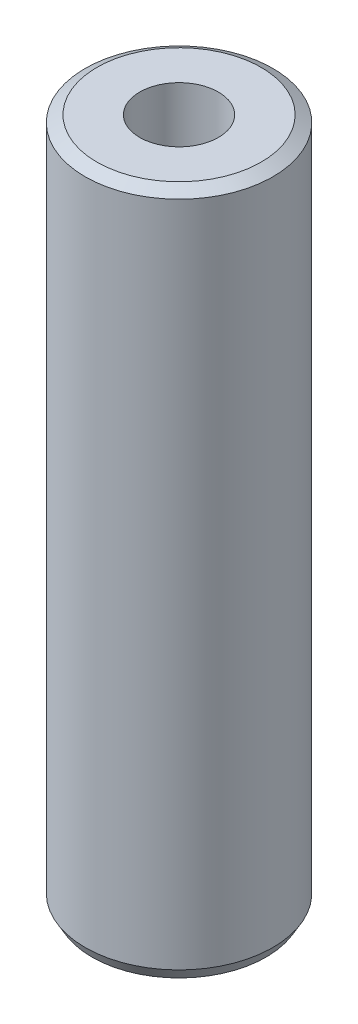
ISO-10303-21;
HEADER;
FILE_DESCRIPTION(('STEP AP214'),'2;1');
FILE_NAME('part.step','',(''),(''),'','','');
FILE_SCHEMA(('AUTOMOTIVE_DESIGN { 1 0 10303 214 1 1 1 1 }'));
ENDSEC;
DATA;
#1=APPLICATION_CONTEXT('core data for automotive mechanical design processes');
#2=APPLICATION_PROTOCOL_DEFINITION('international standard','automotive_design',2000,#1);
#3=PRODUCT_CONTEXT('',#1,'mechanical');
#4=PRODUCT('Part','Part','',(#3));
#5=PRODUCT_RELATED_PRODUCT_CATEGORY('part','',(#4));
#6=PRODUCT_DEFINITION_FORMATION('','',#4);
#7=PRODUCT_DEFINITION_CONTEXT('part definition',#1,'design');
#8=PRODUCT_DEFINITION('design','',#6,#7);
#9=PRODUCT_DEFINITION_SHAPE('','',#8);
#10=(LENGTH_UNIT() NAMED_UNIT(*) SI_UNIT(.MILLI.,.METRE.));
#11=(NAMED_UNIT(*) PLANE_ANGLE_UNIT() SI_UNIT($,.RADIAN.));
#12=(NAMED_UNIT(*) SI_UNIT($,.STERADIAN.) SOLID_ANGLE_UNIT());
#13=UNCERTAINTY_MEASURE_WITH_UNIT(LENGTH_MEASURE(1.E-05),#10,'distance_accuracy_value','');
#14=(GEOMETRIC_REPRESENTATION_CONTEXT(3) GLOBAL_UNCERTAINTY_ASSIGNED_CONTEXT((#13)) GLOBAL_UNIT_ASSIGNED_CONTEXT((#10,
#11,#12)) REPRESENTATION_CONTEXT('',''));
#15=CARTESIAN_POINT('',(0.,0.,0.));
#16=DIRECTION('',(0.,0.,1.));
#17=DIRECTION('',(1.,0.,0.));
#18=AXIS2_PLACEMENT_3D('',#15,#16,#17);
#19=CARTESIAN_POINT('',(0.,401.923267817449,0.));
#20=DIRECTION('',(0.,-1.,0.));
#21=DIRECTION('',(0.,0.,-1.));
#22=AXIS2_PLACEMENT_3D('',#19,#20,#21);
#23=CYLINDRICAL_SURFACE('',#22,55.);
#24=CARTESIAN_POINT('',(0.,397.944061286885,0.));
#25=DIRECTION('',(0.,1.,0.));
#26=DIRECTION('',(0.,0.,1.));
#27=AXIS2_PLACEMENT_3D('',#24,#25,#26);
#28=CIRCLE('',#27,55.);
#29=CARTESIAN_POINT('',(0.,397.944061286885,55.));
#30=VERTEX_POINT('',#29);
#31=EDGE_CURVE('E50',#30,#30,#28,.F.);
#32=ORIENTED_EDGE('',*,*,#31,.T.);
#33=EDGE_LOOP('',(#32));
#34=FACE_BOUND('',#33,.T.);
#35=CARTESIAN_POINT('',(0.,6.89218788474749,0.));
#36=DIRECTION('',(0.,1.,0.));
#37=DIRECTION('',(0.,0.,1.));
#38=AXIS2_PLACEMENT_3D('',#35,#36,#37);
#39=CIRCLE('',#38,55.);
#40=CARTESIAN_POINT('',(0.,6.89218788474749,55.));
#41=VERTEX_POINT('',#40);
#42=EDGE_CURVE('E51',#41,#41,#39,.T.);
#43=ORIENTED_EDGE('',*,*,#42,.T.);
#44=EDGE_LOOP('',(#43));
#45=FACE_BOUND('',#44,.T.);
#46=ADVANCED_FACE('F39',(#34,#45),#23,.T.);
#47=CARTESIAN_POINT('',(0.,401.923267817449,0.));
#48=DIRECTION('',(0.,1.,0.));
#49=DIRECTION('',(0.,0.,1.));
#50=AXIS2_PLACEMENT_3D('',#47,#48,#49);
#51=PLANE('',#50);
#52=CARTESIAN_POINT('',(0.,401.923267817449,0.));
#53=DIRECTION('',(0.,1.,0.));
#54=DIRECTION('',(0.,0.,1.));
#55=AXIS2_PLACEMENT_3D('',#52,#53,#54);
#56=CIRCLE('',#55,48.1078121152522);
#57=CARTESIAN_POINT('',(0.,401.923267817449,48.1078121152522));
#58=VERTEX_POINT('',#57);
#59=EDGE_CURVE('E54',#58,#58,#56,.T.);
#60=ORIENTED_EDGE('',*,*,#59,.T.);
#61=EDGE_LOOP('',(#60));
#62=FACE_BOUND('',#61,.T.);
#63=CARTESIAN_POINT('',(0.,401.923267817449,0.));
#64=DIRECTION('',(0.,1.,0.));
#65=DIRECTION('',(0.,0.,1.));
#66=AXIS2_PLACEMENT_3D('',#63,#64,#65);
#67=CIRCLE('',#66,23.0585629012488);
#68=CARTESIAN_POINT('',(0.,401.923267817449,23.0585629012488));
#69=VERTEX_POINT('',#68);
#70=EDGE_CURVE('E58',#69,#69,#67,.T.);
#71=ORIENTED_EDGE('',*,*,#70,.F.);
#72=EDGE_LOOP('',(#71));
#73=FACE_BOUND('',#72,.T.);
#74=ADVANCED_FACE('F69',(#62,#73),#51,.T.);
#75=CARTESIAN_POINT('',(0.,0.,0.));
#76=DIRECTION('',(0.,1.,0.));
#77=DIRECTION('',(0.,0.,1.));
#78=AXIS2_PLACEMENT_3D('',#75,#76,#77);
#79=PLANE('',#78);
#80=CARTESIAN_POINT('',(0.,0.,0.));
#81=DIRECTION('',(0.,1.,0.));
#82=DIRECTION('',(0.,0.,1.));
#83=AXIS2_PLACEMENT_3D('',#80,#81,#82);
#84=CIRCLE('',#83,51.0207934694355);
#85=CARTESIAN_POINT('',(0.,0.,51.0207934694355));
#86=VERTEX_POINT('',#85);
#87=EDGE_CURVE('E10',#86,#86,#84,.F.);
#88=ORIENTED_EDGE('',*,*,#87,.T.);
#89=EDGE_LOOP('',(#88));
#90=FACE_BOUND('',#89,.T.);
#91=CARTESIAN_POINT('',(0.,0.,0.));
#92=DIRECTION('',(0.,1.,0.));
#93=DIRECTION('',(0.,0.,1.));
#94=AXIS2_PLACEMENT_3D('',#91,#92,#93);
#95=CIRCLE('',#94,23.0585629012488);
#96=CARTESIAN_POINT('',(0.,0.,23.0585629012488));
#97=VERTEX_POINT('',#96);
#98=EDGE_CURVE('E63',#97,#97,#95,.T.);
#99=ORIENTED_EDGE('',*,*,#98,.T.);
#100=EDGE_LOOP('',(#99));
#101=FACE_BOUND('',#100,.T.);
#102=ADVANCED_FACE('F75',(#90,#101),#79,.F.);
#103=CARTESIAN_POINT('',(0.,401.923267817449,0.));
#104=DIRECTION('',(0.,-1.,0.));
#105=DIRECTION('',(0.,0.,-1.));
#106=AXIS2_PLACEMENT_3D('',#103,#104,#105);
#107=CYLINDRICAL_SURFACE('',#106,23.0585629012488);
#108=ORIENTED_EDGE('',*,*,#70,.T.);
#109=EDGE_LOOP('',(#108));
#110=FACE_BOUND('',#109,.T.);
#111=ORIENTED_EDGE('',*,*,#98,.F.);
#112=EDGE_LOOP('',(#111));
#113=FACE_BOUND('',#112,.T.);
#114=ADVANCED_FACE('F70',(#110,#113),#107,.F.);
#115=CARTESIAN_POINT('',(0.,401.923267817449,0.));
#116=DIRECTION('',(0.,-1.,0.));
#117=DIRECTION('',(0.,0.,-1.));
#118=AXIS2_PLACEMENT_3D('',#115,#116,#117);
#119=CONICAL_SURFACE('',#118,48.1078121152522,1.04719755119659);
#120=ORIENTED_EDGE('',*,*,#31,.F.);
#121=EDGE_LOOP('',(#120));
#122=FACE_BOUND('',#121,.T.);
#123=ORIENTED_EDGE('',*,*,#59,.F.);
#124=EDGE_LOOP('',(#123));
#125=FACE_BOUND('',#124,.T.);
#126=ADVANCED_FACE('F81',(#122,#125),#119,.T.);
#127=CARTESIAN_POINT('',(0.,6.89218788474749,0.));
#128=DIRECTION('',(0.,1.,0.));
#129=DIRECTION('',(0.,0.,1.));
#130=AXIS2_PLACEMENT_3D('',#127,#128,#129);
#131=CONICAL_SURFACE('',#130,55.,0.523598775598305);
#132=ORIENTED_EDGE('',*,*,#87,.F.);
#133=EDGE_LOOP('',(#132));
#134=FACE_BOUND('',#133,.T.);
#135=ORIENTED_EDGE('',*,*,#42,.F.);
#136=EDGE_LOOP('',(#135));
#137=FACE_BOUND('',#136,.T.);
#138=ADVANCED_FACE('F45',(#134,#137),#131,.T.);
#139=CLOSED_SHELL('',(#46,#74,#102,#114,#126,#138));
#140=MANIFOLD_SOLID_BREP('B2',#139);
#141=ADVANCED_BREP_SHAPE_REPRESENTATION('',(#18,#140),#14);
#142=SHAPE_DEFINITION_REPRESENTATION(#9,#141);
ENDSEC;
END-ISO-10303-21;
